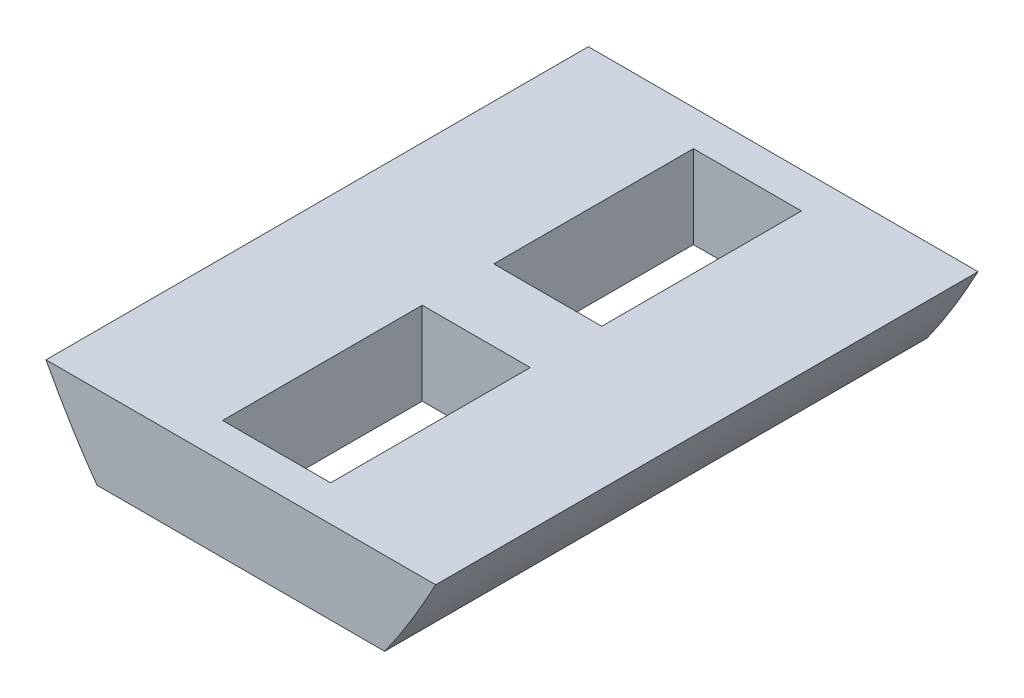
ISO-10303-21;
HEADER;
FILE_DESCRIPTION(('STEP AP214'),'2;1');
FILE_NAME('part.step','',(''),(''),'','','');
FILE_SCHEMA(('AUTOMOTIVE_DESIGN { 1 0 10303 214 1 1 1 1 }'));
ENDSEC;
DATA;
#1=APPLICATION_CONTEXT('core data for automotive mechanical design processes');
#2=APPLICATION_PROTOCOL_DEFINITION('international standard','automotive_design',2000,#1);
#3=PRODUCT_CONTEXT('',#1,'mechanical');
#4=PRODUCT('Part','Part','',(#3));
#5=PRODUCT_RELATED_PRODUCT_CATEGORY('part','',(#4));
#6=PRODUCT_DEFINITION_FORMATION('','',#4);
#7=PRODUCT_DEFINITION_CONTEXT('part definition',#1,'design');
#8=PRODUCT_DEFINITION('design','',#6,#7);
#9=PRODUCT_DEFINITION_SHAPE('','',#8);
#10=(LENGTH_UNIT() NAMED_UNIT(*) SI_UNIT(.MILLI.,.METRE.));
#11=(NAMED_UNIT(*) PLANE_ANGLE_UNIT() SI_UNIT($,.RADIAN.));
#12=(NAMED_UNIT(*) SI_UNIT($,.STERADIAN.) SOLID_ANGLE_UNIT());
#13=UNCERTAINTY_MEASURE_WITH_UNIT(LENGTH_MEASURE(1.E-05),#10,'distance_accuracy_value','');
#14=(GEOMETRIC_REPRESENTATION_CONTEXT(3) GLOBAL_UNCERTAINTY_ASSIGNED_CONTEXT((#13)) GLOBAL_UNIT_ASSIGNED_CONTEXT((#10,
#11,#12)) REPRESENTATION_CONTEXT('',''));
#15=CARTESIAN_POINT('',(0.,0.,0.));
#16=DIRECTION('',(0.,0.,1.));
#17=DIRECTION('',(1.,0.,0.));
#18=AXIS2_PLACEMENT_3D('',#15,#16,#17);
#19=CARTESIAN_POINT('',(-127.000000000214,127.000000000428,331.382));
#20=CARTESIAN_POINT('',(-3.79340656109228E-11,-127.000000000353,331.382));
#21=CARTESIAN_POINT('',(127.000000000138,127.000000000277,331.382));
#22=B_SPLINE_CURVE_WITH_KNOTS('',2,(#19,#20,#21),.UNSPECIFIED.,.F.,.F.,(3,3),
(0.0560283962320779,0.943971603767657),.UNSPECIFIED.);
#23=DIRECTION('',(0.,0.,-1.));
#24=VECTOR('',#23,1.);
#25=SURFACE_OF_LINEAR_EXTRUSION('',#22,#24);
#26=CARTESIAN_POINT('',(-119.051249467909,111.6,331.382));
#27=VERTEX_POINT('',#26);
#28=CARTESIAN_POINT('',(-87.8726351033039,60.8,331.382));
#29=VERTEX_POINT('',#28);
#30=EDGE_CURVE('E135',#27,#29,#22,.T.);
#31=ORIENTED_EDGE('',*,*,#30,.F.);
#32=DIRECTION('',(0.,0.,-1.));
#33=VECTOR('',#32,1.);
#34=CARTESIAN_POINT('',(-119.051249468454,111.6,331.382));
#35=LINE('',#34,#33);
#36=CARTESIAN_POINT('',(-119.051249467909,111.6,0.));
#37=VERTEX_POINT('',#36);
#38=EDGE_CURVE('E121',#27,#37,#35,.T.);
#39=ORIENTED_EDGE('',*,*,#38,.T.);
#40=CARTESIAN_POINT('',(-127.000000000214,127.000000000428,0.));
#41=CARTESIAN_POINT('',(-3.79340656109228E-11,-127.000000000353,0.));
#42=CARTESIAN_POINT('',(127.000000000138,127.000000000277,0.));
#43=B_SPLINE_CURVE_WITH_KNOTS('',2,(#40,#41,#42),.UNSPECIFIED.,.F.,.F.,(3,3),
(0.0560283962320779,0.943971603767657),.UNSPECIFIED.);
#44=CARTESIAN_POINT('',(-87.8726351033039,60.7999999999875,0.));
#45=VERTEX_POINT('',#44);
#46=EDGE_CURVE('E144',#37,#45,#43,.T.);
#47=ORIENTED_EDGE('',*,*,#46,.T.);
#48=DIRECTION('',(0.,0.,-1.));
#49=VECTOR('',#48,1.);
#50=CARTESIAN_POINT('',(-87.872635103313,60.8,331.382));
#51=LINE('',#50,#49);
#52=EDGE_CURVE('E142',#45,#29,#51,.F.);
#53=ORIENTED_EDGE('',*,*,#52,.T.);
#54=EDGE_LOOP('',(#31,#39,#47,#53));
#55=FACE_BOUND('',#54,.T.);
#56=ADVANCED_FACE('F33',(#55),#25,.F.);
#57=CARTESIAN_POINT('',(87.872635103304,60.8,0.));
#58=VERTEX_POINT('',#57);
#59=CARTESIAN_POINT('',(119.051249467909,111.599999998979,0.));
#60=VERTEX_POINT('',#59);
#61=EDGE_CURVE('E157',#58,#60,#43,.T.);
#62=ORIENTED_EDGE('',*,*,#61,.T.);
#63=DIRECTION('',(0.,0.,-1.));
#64=VECTOR('',#63,1.);
#65=CARTESIAN_POINT('',(119.051249468454,111.6,331.382));
#66=LINE('',#65,#64);
#67=CARTESIAN_POINT('',(119.051249467909,111.6,331.382));
#68=VERTEX_POINT('',#67);
#69=EDGE_CURVE('E49',#60,#68,#66,.F.);
#70=ORIENTED_EDGE('',*,*,#69,.T.);
#71=CARTESIAN_POINT('',(87.872635103304,60.8,331.382));
#72=VERTEX_POINT('',#71);
#73=EDGE_CURVE('E138',#72,#68,#22,.T.);
#74=ORIENTED_EDGE('',*,*,#73,.F.);
#75=DIRECTION('',(0.,0.,-1.));
#76=VECTOR('',#75,1.);
#77=CARTESIAN_POINT('',(87.872635103313,60.8,331.382));
#78=LINE('',#77,#76);
#79=EDGE_CURVE('E208',#72,#58,#78,.T.);
#80=ORIENTED_EDGE('',*,*,#79,.T.);
#81=EDGE_LOOP('',(#62,#70,#74,#80));
#82=FACE_BOUND('',#81,.T.);
#83=ADVANCED_FACE('F35',(#82),#25,.F.);
#84=CARTESIAN_POINT('',(-3.79349329726608E-11,0.,331.382));
#85=DIRECTION('',(0.,0.,-1.));
#86=DIRECTION('',(-1.,0.,0.));
#87=AXIS2_PLACEMENT_3D('',#84,#85,#86);
#88=PLANE('',#87);
#89=ORIENTED_EDGE('',*,*,#73,.T.);
#90=DIRECTION('',(1.,0.,0.));
#91=VECTOR('',#90,1.);
#92=CARTESIAN_POINT('',(-130.,111.6,331.382));
#93=LINE('',#92,#91);
#94=EDGE_CURVE('E124',#27,#68,#93,.T.);
#95=ORIENTED_EDGE('',*,*,#94,.F.);
#96=ORIENTED_EDGE('',*,*,#30,.T.);
#97=DIRECTION('',(1.,0.,0.));
#98=VECTOR('',#97,1.);
#99=CARTESIAN_POINT('',(90.,60.8,331.382));
#100=LINE('',#99,#98);
#101=EDGE_CURVE('E226',#29,#72,#100,.T.);
#102=ORIENTED_EDGE('',*,*,#101,.T.);
#103=EDGE_LOOP('',(#89,#95,#96,#102));
#104=FACE_BOUND('',#103,.T.);
#105=ADVANCED_FACE('F133',(#104),#88,.F.);
#106=CARTESIAN_POINT('',(-3.79349329726608E-11,0.,0.));
#107=DIRECTION('',(0.,0.,-1.));
#108=DIRECTION('',(-1.,0.,0.));
#109=AXIS2_PLACEMENT_3D('',#106,#107,#108);
#110=PLANE('',#109);
#111=DIRECTION('',(1.,0.,0.));
#112=VECTOR('',#111,1.);
#113=CARTESIAN_POINT('',(-130.,111.6,0.));
#114=LINE('',#113,#112);
#115=EDGE_CURVE('E125',#37,#60,#114,.T.);
#116=ORIENTED_EDGE('',*,*,#115,.T.);
#117=ORIENTED_EDGE('',*,*,#61,.F.);
#118=DIRECTION('',(1.,0.,0.));
#119=VECTOR('',#118,1.);
#120=CARTESIAN_POINT('',(90.,60.8,0.));
#121=LINE('',#120,#119);
#122=EDGE_CURVE('E129',#45,#58,#121,.T.);
#123=ORIENTED_EDGE('',*,*,#122,.F.);
#124=ORIENTED_EDGE('',*,*,#46,.F.);
#125=EDGE_LOOP('',(#116,#117,#123,#124));
#126=FACE_BOUND('',#125,.T.);
#127=ADVANCED_FACE('F246',(#126),#110,.T.);
#128=CARTESIAN_POINT('',(-33.,-3.79141162909491E-11,21.8455));
#129=DIRECTION('',(-1.,0.,0.));
#130=DIRECTION('',(0.,0.,1.));
#131=AXIS2_PLACEMENT_3D('',#128,#129,#130);
#132=PLANE('',#131);
#133=DIRECTION('',(0.,1.,0.));
#134=VECTOR('',#133,1.);
#135=CARTESIAN_POINT('',(-33.,-3.79141162909491E-11,21.8455));
#136=LINE('',#135,#134);
#137=CARTESIAN_POINT('',(-33.,60.8,21.8455));
#138=VERTEX_POINT('',#137);
#139=CARTESIAN_POINT('',(-33.,111.6,21.8455));
#140=VERTEX_POINT('',#139);
#141=EDGE_CURVE('E162',#138,#140,#136,.T.);
#142=ORIENTED_EDGE('',*,*,#141,.T.);
#143=DIRECTION('',(0.,0.,1.));
#144=VECTOR('',#143,1.);
#145=CARTESIAN_POINT('',(-33.,111.6,21.8455));
#146=LINE('',#145,#144);
#147=CARTESIAN_POINT('',(-33.,111.6,143.8455));
#148=VERTEX_POINT('',#147);
#149=EDGE_CURVE('E230',#140,#148,#146,.T.);
#150=ORIENTED_EDGE('',*,*,#149,.T.);
#151=DIRECTION('',(0.,1.,0.));
#152=VECTOR('',#151,1.);
#153=CARTESIAN_POINT('',(-33.,-3.79141162909491E-11,143.8455));
#154=LINE('',#153,#152);
#155=CARTESIAN_POINT('',(-33.,60.8,143.8455));
#156=VERTEX_POINT('',#155);
#157=EDGE_CURVE('E150',#156,#148,#154,.T.);
#158=ORIENTED_EDGE('',*,*,#157,.F.);
#159=DIRECTION('',(0.,0.,-1.));
#160=VECTOR('',#159,1.);
#161=CARTESIAN_POINT('',(-33.,60.8,21.8455));
#162=LINE('',#161,#160);
#163=EDGE_CURVE('E209',#156,#138,#162,.T.);
#164=ORIENTED_EDGE('',*,*,#163,.T.);
#165=EDGE_LOOP('',(#142,#150,#158,#164));
#166=FACE_BOUND('',#165,.T.);
#167=ADVANCED_FACE('F282',(#166),#132,.F.);
#168=CARTESIAN_POINT('',(-33.,-3.79141162909491E-11,21.8455));
#169=DIRECTION('',(0.,0.,-1.));
#170=DIRECTION('',(-1.,0.,0.));
#171=AXIS2_PLACEMENT_3D('',#168,#169,#170);
#172=PLANE('',#171);
#173=DIRECTION('',(0.,1.,0.));
#174=VECTOR('',#173,1.);
#175=CARTESIAN_POINT('',(33.,-3.79141162909491E-11,21.8455));
#176=LINE('',#175,#174);
#177=CARTESIAN_POINT('',(33.,60.8,21.8455));
#178=VERTEX_POINT('',#177);
#179=CARTESIAN_POINT('',(33.,111.6,21.8455));
#180=VERTEX_POINT('',#179);
#181=EDGE_CURVE('E167',#178,#180,#176,.T.);
#182=ORIENTED_EDGE('',*,*,#181,.T.);
#183=DIRECTION('',(-1.,0.,0.));
#184=VECTOR('',#183,1.);
#185=CARTESIAN_POINT('',(-33.,111.6,21.8455));
#186=LINE('',#185,#184);
#187=EDGE_CURVE('E232',#180,#140,#186,.T.);
#188=ORIENTED_EDGE('',*,*,#187,.T.);
#189=ORIENTED_EDGE('',*,*,#141,.F.);
#190=DIRECTION('',(1.,0.,0.));
#191=VECTOR('',#190,1.);
#192=CARTESIAN_POINT('',(-33.,60.8,21.8455));
#193=LINE('',#192,#191);
#194=EDGE_CURVE('E210',#138,#178,#193,.T.);
#195=ORIENTED_EDGE('',*,*,#194,.T.);
#196=EDGE_LOOP('',(#182,#188,#189,#195));
#197=FACE_BOUND('',#196,.T.);
#198=ADVANCED_FACE('F290',(#197),#172,.F.);
#199=CARTESIAN_POINT('',(33.,-3.79141162909491E-11,21.8455));
#200=DIRECTION('',(1.,0.,0.));
#201=DIRECTION('',(0.,0.,-1.));
#202=AXIS2_PLACEMENT_3D('',#199,#200,#201);
#203=PLANE('',#202);
#204=DIRECTION('',(0.,1.,0.));
#205=VECTOR('',#204,1.);
#206=CARTESIAN_POINT('',(33.,-3.79141162909491E-11,143.8455));
#207=LINE('',#206,#205);
#208=CARTESIAN_POINT('',(33.,60.8,143.8455));
#209=VERTEX_POINT('',#208);
#210=CARTESIAN_POINT('',(33.,111.6,143.8455));
#211=VERTEX_POINT('',#210);
#212=EDGE_CURVE('E174',#209,#211,#207,.T.);
#213=ORIENTED_EDGE('',*,*,#212,.T.);
#214=DIRECTION('',(0.,0.,-1.));
#215=VECTOR('',#214,1.);
#216=CARTESIAN_POINT('',(33.,111.6,21.8455));
#217=LINE('',#216,#215);
#218=EDGE_CURVE('E57',#211,#180,#217,.T.);
#219=ORIENTED_EDGE('',*,*,#218,.T.);
#220=ORIENTED_EDGE('',*,*,#181,.F.);
#221=DIRECTION('',(0.,0.,1.));
#222=VECTOR('',#221,1.);
#223=CARTESIAN_POINT('',(33.,60.8,21.8455));
#224=LINE('',#223,#222);
#225=EDGE_CURVE('E215',#178,#209,#224,.T.);
#226=ORIENTED_EDGE('',*,*,#225,.T.);
#227=EDGE_LOOP('',(#213,#219,#220,#226));
#228=FACE_BOUND('',#227,.T.);
#229=ADVANCED_FACE('F299',(#228),#203,.F.);
#230=CARTESIAN_POINT('',(-33.,-3.79141162909491E-11,143.8455));
#231=DIRECTION('',(0.,0.,1.));
#232=DIRECTION('',(1.,0.,0.));
#233=AXIS2_PLACEMENT_3D('',#230,#231,#232);
#234=PLANE('',#233);
#235=ORIENTED_EDGE('',*,*,#157,.T.);
#236=DIRECTION('',(1.,0.,0.));
#237=VECTOR('',#236,1.);
#238=CARTESIAN_POINT('',(-33.,111.6,143.8455));
#239=LINE('',#238,#237);
#240=EDGE_CURVE('E236',#148,#211,#239,.T.);
#241=ORIENTED_EDGE('',*,*,#240,.T.);
#242=ORIENTED_EDGE('',*,*,#212,.F.);
#243=DIRECTION('',(-1.,0.,0.));
#244=VECTOR('',#243,1.);
#245=CARTESIAN_POINT('',(-33.,60.8,143.8455));
#246=LINE('',#245,#244);
#247=EDGE_CURVE('E217',#209,#156,#246,.T.);
#248=ORIENTED_EDGE('',*,*,#247,.T.);
#249=EDGE_LOOP('',(#235,#241,#242,#248));
#250=FACE_BOUND('',#249,.T.);
#251=ADVANCED_FACE('F309',(#250),#234,.F.);
#252=CARTESIAN_POINT('',(-33.,-3.79141162909491E-11,187.5365));
#253=DIRECTION('',(-1.,0.,0.));
#254=DIRECTION('',(0.,0.,1.));
#255=AXIS2_PLACEMENT_3D('',#252,#253,#254);
#256=PLANE('',#255);
#257=DIRECTION('',(0.,1.,0.));
#258=VECTOR('',#257,1.);
#259=CARTESIAN_POINT('',(-33.,-3.79141162909491E-11,187.5365));
#260=LINE('',#259,#258);
#261=CARTESIAN_POINT('',(-33.,60.8,187.5365));
#262=VERTEX_POINT('',#261);
#263=CARTESIAN_POINT('',(-33.,111.6,187.5365));
#264=VERTEX_POINT('',#263);
#265=EDGE_CURVE('E184',#262,#264,#260,.T.);
#266=ORIENTED_EDGE('',*,*,#265,.T.);
#267=DIRECTION('',(0.,0.,1.));
#268=VECTOR('',#267,1.);
#269=CARTESIAN_POINT('',(-33.,111.6,187.5365));
#270=LINE('',#269,#268);
#271=CARTESIAN_POINT('',(-33.,111.6,309.5365));
#272=VERTEX_POINT('',#271);
#273=EDGE_CURVE('E238',#264,#272,#270,.T.);
#274=ORIENTED_EDGE('',*,*,#273,.T.);
#275=DIRECTION('',(0.,1.,0.));
#276=VECTOR('',#275,1.);
#277=CARTESIAN_POINT('',(-33.,-3.79141162909491E-11,309.5365));
#278=LINE('',#277,#276);
#279=CARTESIAN_POINT('',(-33.,60.8,309.5365));
#280=VERTEX_POINT('',#279);
#281=EDGE_CURVE('E177',#280,#272,#278,.T.);
#282=ORIENTED_EDGE('',*,*,#281,.F.);
#283=DIRECTION('',(0.,0.,-1.));
#284=VECTOR('',#283,1.);
#285=CARTESIAN_POINT('',(-33.,60.8,187.5365));
#286=LINE('',#285,#284);
#287=EDGE_CURVE('E219',#280,#262,#286,.T.);
#288=ORIENTED_EDGE('',*,*,#287,.T.);
#289=EDGE_LOOP('',(#266,#274,#282,#288));
#290=FACE_BOUND('',#289,.T.);
#291=ADVANCED_FACE('F318',(#290),#256,.F.);
#292=CARTESIAN_POINT('',(-33.,-3.79141162909491E-11,187.5365));
#293=DIRECTION('',(0.,0.,-1.));
#294=DIRECTION('',(-1.,0.,0.));
#295=AXIS2_PLACEMENT_3D('',#292,#293,#294);
#296=PLANE('',#295);
#297=DIRECTION('',(0.,1.,0.));
#298=VECTOR('',#297,1.);
#299=CARTESIAN_POINT('',(33.,-3.79141162909491E-11,187.5365));
#300=LINE('',#299,#298);
#301=CARTESIAN_POINT('',(33.,60.8,187.5365));
#302=VERTEX_POINT('',#301);
#303=CARTESIAN_POINT('',(33.,111.6,187.5365));
#304=VERTEX_POINT('',#303);
#305=EDGE_CURVE('E189',#302,#304,#300,.T.);
#306=ORIENTED_EDGE('',*,*,#305,.T.);
#307=DIRECTION('',(-1.,0.,0.));
#308=VECTOR('',#307,1.);
#309=CARTESIAN_POINT('',(-33.,111.6,187.5365));
#310=LINE('',#309,#308);
#311=EDGE_CURVE('E240',#304,#264,#310,.T.);
#312=ORIENTED_EDGE('',*,*,#311,.T.);
#313=ORIENTED_EDGE('',*,*,#265,.F.);
#314=DIRECTION('',(1.,0.,0.));
#315=VECTOR('',#314,1.);
#316=CARTESIAN_POINT('',(-33.,60.8,187.5365));
#317=LINE('',#316,#315);
#318=EDGE_CURVE('E221',#262,#302,#317,.T.);
#319=ORIENTED_EDGE('',*,*,#318,.T.);
#320=EDGE_LOOP('',(#306,#312,#313,#319));
#321=FACE_BOUND('',#320,.T.);
#322=ADVANCED_FACE('F327',(#321),#296,.F.);
#323=CARTESIAN_POINT('',(33.,-3.79141162909491E-11,187.5365));
#324=DIRECTION('',(1.,0.,0.));
#325=DIRECTION('',(0.,0.,-1.));
#326=AXIS2_PLACEMENT_3D('',#323,#324,#325);
#327=PLANE('',#326);
#328=DIRECTION('',(0.,1.,0.));
#329=VECTOR('',#328,1.);
#330=CARTESIAN_POINT('',(33.,-3.79141162909491E-11,309.5365));
#331=LINE('',#330,#329);
#332=CARTESIAN_POINT('',(33.,60.8,309.5365));
#333=VERTEX_POINT('',#332);
#334=CARTESIAN_POINT('',(33.,111.6,309.5365));
#335=VERTEX_POINT('',#334);
#336=EDGE_CURVE('E196',#333,#335,#331,.T.);
#337=ORIENTED_EDGE('',*,*,#336,.T.);
#338=DIRECTION('',(0.,0.,-1.));
#339=VECTOR('',#338,1.);
#340=CARTESIAN_POINT('',(33.,111.6,187.5365));
#341=LINE('',#340,#339);
#342=EDGE_CURVE('E243',#335,#304,#341,.T.);
#343=ORIENTED_EDGE('',*,*,#342,.T.);
#344=ORIENTED_EDGE('',*,*,#305,.F.);
#345=DIRECTION('',(0.,0.,1.));
#346=VECTOR('',#345,1.);
#347=CARTESIAN_POINT('',(33.,60.8,187.5365));
#348=LINE('',#347,#346);
#349=EDGE_CURVE('E224',#302,#333,#348,.T.);
#350=ORIENTED_EDGE('',*,*,#349,.T.);
#351=EDGE_LOOP('',(#337,#343,#344,#350));
#352=FACE_BOUND('',#351,.T.);
#353=ADVANCED_FACE('F336',(#352),#327,.F.);
#354=CARTESIAN_POINT('',(-33.,-3.79141162909491E-11,309.5365));
#355=DIRECTION('',(0.,0.,1.));
#356=DIRECTION('',(1.,0.,0.));
#357=AXIS2_PLACEMENT_3D('',#354,#355,#356);
#358=PLANE('',#357);
#359=ORIENTED_EDGE('',*,*,#281,.T.);
#360=DIRECTION('',(1.,0.,0.));
#361=VECTOR('',#360,1.);
#362=CARTESIAN_POINT('',(-33.,111.6,309.5365));
#363=LINE('',#362,#361);
#364=EDGE_CURVE('E11',#272,#335,#363,.T.);
#365=ORIENTED_EDGE('',*,*,#364,.T.);
#366=ORIENTED_EDGE('',*,*,#336,.F.);
#367=DIRECTION('',(-1.,0.,0.));
#368=VECTOR('',#367,1.);
#369=CARTESIAN_POINT('',(-33.,60.8,309.5365));
#370=LINE('',#369,#368);
#371=EDGE_CURVE('E42',#333,#280,#370,.T.);
#372=ORIENTED_EDGE('',*,*,#371,.T.);
#373=EDGE_LOOP('',(#359,#365,#366,#372));
#374=FACE_BOUND('',#373,.T.);
#375=ADVANCED_FACE('F346',(#374),#358,.F.);
#376=CARTESIAN_POINT('',(90.,60.8,331.382));
#377=DIRECTION('',(0.,1.,0.));
#378=DIRECTION('',(0.,0.,1.));
#379=AXIS2_PLACEMENT_3D('',#376,#377,#378);
#380=PLANE('',#379);
#381=ORIENTED_EDGE('',*,*,#371,.F.);
#382=ORIENTED_EDGE('',*,*,#349,.F.);
#383=ORIENTED_EDGE('',*,*,#318,.F.);
#384=ORIENTED_EDGE('',*,*,#287,.F.);
#385=EDGE_LOOP('',(#381,#382,#383,#384));
#386=FACE_BOUND('',#385,.T.);
#387=ORIENTED_EDGE('',*,*,#247,.F.);
#388=ORIENTED_EDGE('',*,*,#225,.F.);
#389=ORIENTED_EDGE('',*,*,#194,.F.);
#390=ORIENTED_EDGE('',*,*,#163,.F.);
#391=EDGE_LOOP('',(#387,#388,#389,#390));
#392=FACE_BOUND('',#391,.T.);
#393=ORIENTED_EDGE('',*,*,#122,.T.);
#394=ORIENTED_EDGE('',*,*,#79,.F.);
#395=ORIENTED_EDGE('',*,*,#101,.F.);
#396=ORIENTED_EDGE('',*,*,#52,.F.);
#397=EDGE_LOOP('',(#393,#394,#395,#396));
#398=FACE_BOUND('',#397,.T.);
#399=ADVANCED_FACE('F249',(#386,#392,#398),#380,.F.);
#400=CARTESIAN_POINT('',(-130.,111.6,0.));
#401=DIRECTION('',(0.,-1.,0.));
#402=DIRECTION('',(0.,0.,-1.));
#403=AXIS2_PLACEMENT_3D('',#400,#401,#402);
#404=PLANE('',#403);
#405=ORIENTED_EDGE('',*,*,#311,.F.);
#406=ORIENTED_EDGE('',*,*,#342,.F.);
#407=ORIENTED_EDGE('',*,*,#364,.F.);
#408=ORIENTED_EDGE('',*,*,#273,.F.);
#409=EDGE_LOOP('',(#405,#406,#407,#408));
#410=FACE_BOUND('',#409,.T.);
#411=ORIENTED_EDGE('',*,*,#187,.F.);
#412=ORIENTED_EDGE('',*,*,#218,.F.);
#413=ORIENTED_EDGE('',*,*,#240,.F.);
#414=ORIENTED_EDGE('',*,*,#149,.F.);
#415=EDGE_LOOP('',(#411,#412,#413,#414));
#416=FACE_BOUND('',#415,.T.);
#417=ORIENTED_EDGE('',*,*,#94,.T.);
#418=ORIENTED_EDGE('',*,*,#69,.F.);
#419=ORIENTED_EDGE('',*,*,#115,.F.);
#420=ORIENTED_EDGE('',*,*,#38,.F.);
#421=EDGE_LOOP('',(#417,#418,#419,#420));
#422=FACE_BOUND('',#421,.T.);
#423=ADVANCED_FACE('F123',(#410,#416,#422),#404,.F.);
#424=CLOSED_SHELL('',(#56,#83,#105,#127,#167,#198,#229,#251,#291,#322,#353,#375,#399,#423));
#425=MANIFOLD_SOLID_BREP('B2',#424);
#426=ADVANCED_BREP_SHAPE_REPRESENTATION('',(#18,#425),#14);
#427=SHAPE_DEFINITION_REPRESENTATION(#9,#426);
ENDSEC;
END-ISO-10303-21;
